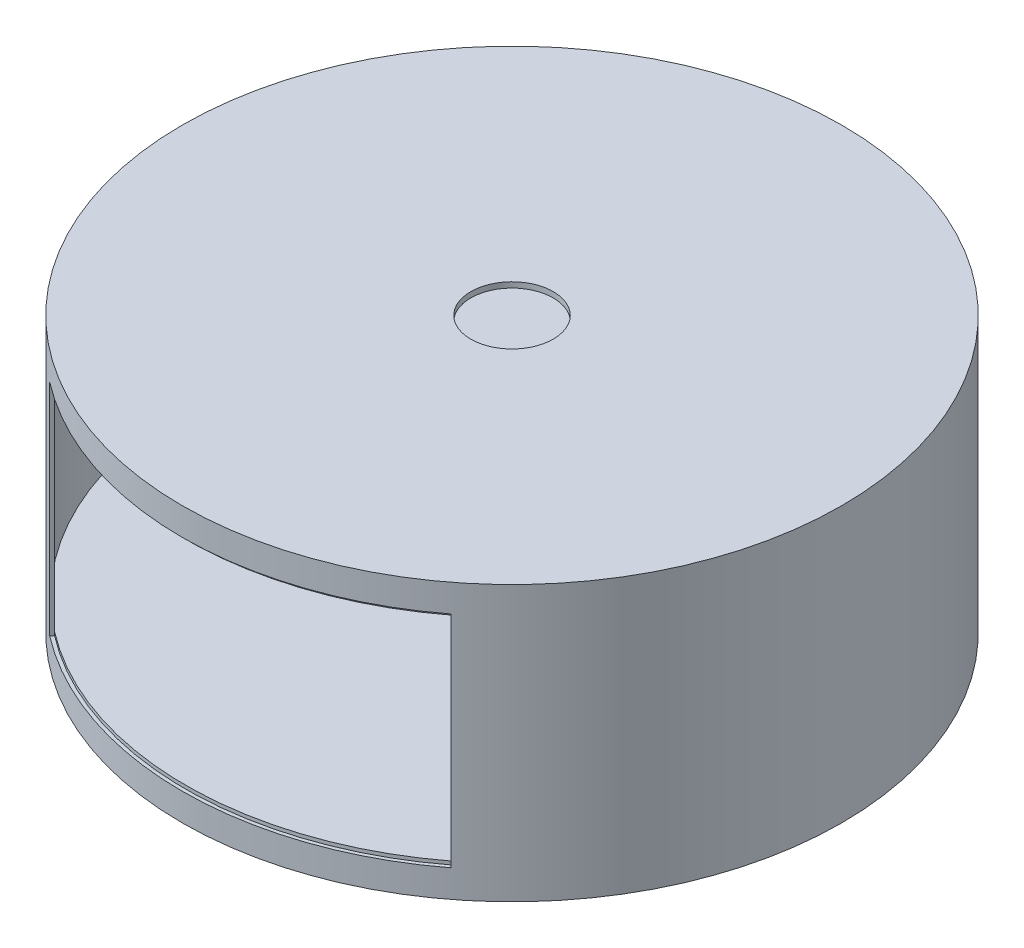
ISO-10303-21;
HEADER;
FILE_DESCRIPTION(('STEP AP214'),'2;1');
FILE_NAME('part.step','',(''),(''),'','','');
FILE_SCHEMA(('AUTOMOTIVE_DESIGN { 1 0 10303 214 1 1 1 1 }'));
ENDSEC;
DATA;
#1=APPLICATION_CONTEXT('core data for automotive mechanical design processes');
#2=APPLICATION_PROTOCOL_DEFINITION('international standard','automotive_design',2000,#1);
#3=PRODUCT_CONTEXT('',#1,'mechanical');
#4=PRODUCT('Part','Part','',(#3));
#5=PRODUCT_RELATED_PRODUCT_CATEGORY('part','',(#4));
#6=PRODUCT_DEFINITION_FORMATION('','',#4);
#7=PRODUCT_DEFINITION_CONTEXT('part definition',#1,'design');
#8=PRODUCT_DEFINITION('design','',#6,#7);
#9=PRODUCT_DEFINITION_SHAPE('','',#8);
#10=(LENGTH_UNIT() NAMED_UNIT(*) SI_UNIT(.MILLI.,.METRE.));
#11=(NAMED_UNIT(*) PLANE_ANGLE_UNIT() SI_UNIT($,.RADIAN.));
#12=(NAMED_UNIT(*) SI_UNIT($,.STERADIAN.) SOLID_ANGLE_UNIT());
#13=UNCERTAINTY_MEASURE_WITH_UNIT(LENGTH_MEASURE(1.E-05),#10,'distance_accuracy_value','');
#14=(GEOMETRIC_REPRESENTATION_CONTEXT(3) GLOBAL_UNCERTAINTY_ASSIGNED_CONTEXT((#13)) GLOBAL_UNIT_ASSIGNED_CONTEXT((#10,
#11,#12)) REPRESENTATION_CONTEXT('',''));
#15=CARTESIAN_POINT('',(0.,0.,0.));
#16=DIRECTION('',(0.,0.,1.));
#17=DIRECTION('',(1.,0.,0.));
#18=AXIS2_PLACEMENT_3D('',#15,#16,#17);
#19=CARTESIAN_POINT('',(0.,-49.2125,0.));
#20=DIRECTION('',(0.,1.,0.));
#21=DIRECTION('',(0.,0.,1.));
#22=AXIS2_PLACEMENT_3D('',#19,#20,#21);
#23=CYLINDRICAL_SURFACE('',#22,150.8125);
#24=CARTESIAN_POINT('',(0.,-49.2125,0.));
#25=DIRECTION('',(0.,1.,0.));
#26=DIRECTION('',(0.,0.,1.));
#27=AXIS2_PLACEMENT_3D('',#24,#25,#26);
#28=CIRCLE('',#27,150.8125);
#29=CARTESIAN_POINT('',(91.8088330123779,-49.2125,119.647600632672));
#30=VERTEX_POINT('',#29);
#31=CARTESIAN_POINT('',(-91.8088330123778,-49.2125,119.647600632672));
#32=VERTEX_POINT('',#31);
#33=EDGE_CURVE('E119',#30,#32,#28,.T.);
#34=ORIENTED_EDGE('',*,*,#33,.F.);
#35=DIRECTION('',(0.,1.,0.));
#36=VECTOR('',#35,1.);
#37=CARTESIAN_POINT('',(91.8088330123779,-50.8,119.647600632672));
#38=LINE('',#37,#36);
#39=CARTESIAN_POINT('',(91.8088330123779,49.2125,119.647600632672));
#40=VERTEX_POINT('',#39);
#41=EDGE_CURVE('E139',#30,#40,#38,.T.);
#42=ORIENTED_EDGE('',*,*,#41,.T.);
#43=CARTESIAN_POINT('',(0.,49.2125,0.));
#44=DIRECTION('',(0.,1.,0.));
#45=DIRECTION('',(0.,0.,1.));
#46=AXIS2_PLACEMENT_3D('',#43,#44,#45);
#47=CIRCLE('',#46,150.8125);
#48=CARTESIAN_POINT('',(-91.8088330123778,49.2125,119.647600632672));
#49=VERTEX_POINT('',#48);
#50=EDGE_CURVE('E122',#40,#49,#47,.T.);
#51=ORIENTED_EDGE('',*,*,#50,.T.);
#52=DIRECTION('',(0.,1.,0.));
#53=VECTOR('',#52,1.);
#54=CARTESIAN_POINT('',(-91.8088330123778,-50.8,119.647600632672));
#55=LINE('',#54,#53);
#56=EDGE_CURVE('E56',#32,#49,#55,.T.);
#57=ORIENTED_EDGE('',*,*,#56,.F.);
#58=EDGE_LOOP('',(#34,#42,#51,#57));
#59=FACE_BOUND('',#58,.T.);
#60=ADVANCED_FACE('F35',(#59),#23,.F.);
#61=CARTESIAN_POINT('',(0.,-49.2125,0.));
#62=DIRECTION('',(0.,1.,0.));
#63=DIRECTION('',(0.,0.,1.));
#64=AXIS2_PLACEMENT_3D('',#61,#62,#63);
#65=PLANE('',#64);
#66=ORIENTED_EDGE('',*,*,#33,.T.);
#67=CARTESIAN_POINT('',(0.,-49.2125,0.));
#68=DIRECTION('',(0.,1.,0.));
#69=DIRECTION('',(0.,0.,1.));
#70=AXIS2_PLACEMENT_3D('',#67,#68,#69);
#71=CIRCLE('',#70,150.8125);
#72=EDGE_CURVE('E110',#32,#30,#71,.T.);
#73=ORIENTED_EDGE('',*,*,#72,.T.);
#74=EDGE_LOOP('',(#66,#73));
#75=FACE_BOUND('',#74,.T.);
#76=ADVANCED_FACE('F148',(#75),#65,.T.);
#77=CARTESIAN_POINT('',(0.,49.2125,0.));
#78=DIRECTION('',(0.,1.,0.));
#79=DIRECTION('',(0.,0.,1.));
#80=AXIS2_PLACEMENT_3D('',#77,#78,#79);
#81=PLANE('',#80);
#82=ORIENTED_EDGE('',*,*,#50,.F.);
#83=EDGE_CURVE('E118',#49,#40,#47,.T.);
#84=ORIENTED_EDGE('',*,*,#83,.F.);
#85=EDGE_LOOP('',(#82,#84));
#86=FACE_BOUND('',#85,.T.);
#87=ADVANCED_FACE('F146',(#86),#81,.F.);
#88=CARTESIAN_POINT('',(0.,0.,0.));
#89=DIRECTION('',(0.,-1.,0.));
#90=DIRECTION('',(0.,0.,-1.));
#91=AXIS2_PLACEMENT_3D('',#88,#89,#90);
#92=CYLINDRICAL_SURFACE('',#91,150.8125);
#93=ORIENTED_EDGE('',*,*,#83,.T.);
#94=CARTESIAN_POINT('',(91.8088330123779,50.8,119.647600632672));
#95=VERTEX_POINT('',#94);
#96=EDGE_CURVE('E132',#40,#95,#38,.T.);
#97=ORIENTED_EDGE('',*,*,#96,.T.);
#98=CARTESIAN_POINT('',(0.,50.8,0.));
#99=DIRECTION('',(0.,-1.,0.));
#100=DIRECTION('',(0.,0.,-1.));
#101=AXIS2_PLACEMENT_3D('',#98,#99,#100);
#102=CIRCLE('',#101,150.8125);
#103=CARTESIAN_POINT('',(-91.8088330123779,50.8,119.647600632672));
#104=VERTEX_POINT('',#103);
#105=EDGE_CURVE('E112',#95,#104,#102,.T.);
#106=ORIENTED_EDGE('',*,*,#105,.T.);
#107=EDGE_CURVE('E102',#49,#104,#55,.T.);
#108=ORIENTED_EDGE('',*,*,#107,.F.);
#109=EDGE_LOOP('',(#93,#97,#106,#108));
#110=FACE_BOUND('',#109,.T.);
#111=ADVANCED_FACE('F130',(#110),#92,.T.);
#112=CARTESIAN_POINT('',(91.8088330123779,50.8,119.647600632672));
#113=DIRECTION('',(0.,-1.,0.));
#114=DIRECTION('',(0.,0.,-1.));
#115=AXIS2_PLACEMENT_3D('',#112,#113,#114);
#116=PLANE('',#115);
#117=CARTESIAN_POINT('',(0.,50.8,0.));
#118=DIRECTION('',(0.,-1.,0.));
#119=DIRECTION('',(0.,0.,-1.));
#120=AXIS2_PLACEMENT_3D('',#117,#118,#119);
#121=CIRCLE('',#120,152.4);
#122=CARTESIAN_POINT('',(92.7752417809292,50.8,120.907049060384));
#123=VERTEX_POINT('',#122);
#124=CARTESIAN_POINT('',(-92.7752417809292,50.8,120.907049060384));
#125=VERTEX_POINT('',#124);
#126=EDGE_CURVE('E108',#123,#125,#121,.T.);
#127=ORIENTED_EDGE('',*,*,#126,.T.);
#128=DIRECTION('',(-0.608761429008722,0.,0.793353340291234));
#129=VECTOR('',#128,1.);
#130=CARTESIAN_POINT('',(-91.8088330123779,50.8,119.647600632672));
#131=LINE('',#130,#129);
#132=EDGE_CURVE('E50',#104,#125,#131,.T.);
#133=ORIENTED_EDGE('',*,*,#132,.F.);
#134=ORIENTED_EDGE('',*,*,#105,.F.);
#135=DIRECTION('',(0.608761429008722,0.,0.793353340291234));
#136=VECTOR('',#135,1.);
#137=CARTESIAN_POINT('',(91.8088330123779,50.8,119.647600632672));
#138=LINE('',#137,#136);
#139=EDGE_CURVE('E141',#95,#123,#138,.T.);
#140=ORIENTED_EDGE('',*,*,#139,.T.);
#141=EDGE_LOOP('',(#127,#133,#134,#140));
#142=FACE_BOUND('',#141,.T.);
#143=ADVANCED_FACE('F154',(#142),#116,.T.);
#144=CARTESIAN_POINT('',(92.7752417809292,-50.8,120.907049060384));
#145=DIRECTION('',(0.,1.,0.));
#146=DIRECTION('',(0.,0.,1.));
#147=AXIS2_PLACEMENT_3D('',#144,#145,#146);
#148=PLANE('',#147);
#149=CARTESIAN_POINT('',(0.,-50.8,0.));
#150=DIRECTION('',(0.,-1.,0.));
#151=DIRECTION('',(0.,0.,-1.));
#152=AXIS2_PLACEMENT_3D('',#149,#150,#151);
#153=CIRCLE('',#152,150.8125);
#154=CARTESIAN_POINT('',(91.8088330123779,-50.8,119.647600632672));
#155=VERTEX_POINT('',#154);
#156=CARTESIAN_POINT('',(-91.8088330123778,-50.8,119.647600632672));
#157=VERTEX_POINT('',#156);
#158=EDGE_CURVE('E101',#155,#157,#153,.T.);
#159=ORIENTED_EDGE('',*,*,#158,.T.);
#160=DIRECTION('',(0.608761429008722,0.,-0.793353340291234));
#161=VECTOR('',#160,1.);
#162=CARTESIAN_POINT('',(-92.7752417809292,-50.8,120.907049060384));
#163=LINE('',#162,#161);
#164=CARTESIAN_POINT('',(-92.7752417809292,-50.8,120.907049060384));
#165=VERTEX_POINT('',#164);
#166=EDGE_CURVE('E90',#165,#157,#163,.T.);
#167=ORIENTED_EDGE('',*,*,#166,.F.);
#168=CARTESIAN_POINT('',(0.,-50.8,0.));
#169=DIRECTION('',(0.,-1.,0.));
#170=DIRECTION('',(0.,0.,-1.));
#171=AXIS2_PLACEMENT_3D('',#168,#169,#170);
#172=CIRCLE('',#171,152.4);
#173=CARTESIAN_POINT('',(92.7752417809292,-50.8,120.907049060384));
#174=VERTEX_POINT('',#173);
#175=EDGE_CURVE('E99',#174,#165,#172,.T.);
#176=ORIENTED_EDGE('',*,*,#175,.F.);
#177=DIRECTION('',(-0.608761429008722,0.,-0.793353340291234));
#178=VECTOR('',#177,1.);
#179=CARTESIAN_POINT('',(92.7752417809292,-50.8,120.907049060384));
#180=LINE('',#179,#178);
#181=EDGE_CURVE('E142',#174,#155,#180,.T.);
#182=ORIENTED_EDGE('',*,*,#181,.T.);
#183=EDGE_LOOP('',(#159,#167,#176,#182));
#184=FACE_BOUND('',#183,.T.);
#185=ADVANCED_FACE('F97',(#184),#148,.T.);
#186=EDGE_CURVE('E251',#157,#32,#55,.T.);
#187=ORIENTED_EDGE('',*,*,#186,.F.);
#188=ORIENTED_EDGE('',*,*,#158,.F.);
#189=EDGE_CURVE('E144',#155,#30,#38,.T.);
#190=ORIENTED_EDGE('',*,*,#189,.T.);
#191=ORIENTED_EDGE('',*,*,#72,.F.);
#192=EDGE_LOOP('',(#187,#188,#190,#191));
#193=FACE_BOUND('',#192,.T.);
#194=ADVANCED_FACE('F156',(#193),#92,.T.);
#195=CARTESIAN_POINT('',(0.,0.,0.));
#196=DIRECTION('',(0.793353340291234,0.,-0.608761429008722));
#197=DIRECTION('',(-0.608761429008722,0.,-0.793353340291234));
#198=AXIS2_PLACEMENT_3D('',#195,#196,#197);
#199=PLANE('',#198);
#200=ORIENTED_EDGE('',*,*,#139,.F.);
#201=ORIENTED_EDGE('',*,*,#96,.F.);
#202=ORIENTED_EDGE('',*,*,#41,.F.);
#203=ORIENTED_EDGE('',*,*,#189,.F.);
#204=ORIENTED_EDGE('',*,*,#181,.F.);
#205=DIRECTION('',(0.,-1.,0.));
#206=VECTOR('',#205,1.);
#207=CARTESIAN_POINT('',(92.7752417809292,50.8,120.907049060384));
#208=LINE('',#207,#206);
#209=EDGE_CURVE('E107',#123,#174,#208,.T.);
#210=ORIENTED_EDGE('',*,*,#209,.F.);
#211=EDGE_LOOP('',(#200,#201,#202,#203,#204,#210));
#212=FACE_BOUND('',#211,.T.);
#213=ADVANCED_FACE('F137',(#212),#199,.F.);
#214=CARTESIAN_POINT('',(0.,0.,0.));
#215=DIRECTION('',(0.793353340291234,0.,0.608761429008722));
#216=DIRECTION('',(0.608761429008722,0.,-0.793353340291234));
#217=AXIS2_PLACEMENT_3D('',#214,#215,#216);
#218=PLANE('',#217);
#219=ORIENTED_EDGE('',*,*,#132,.T.);
#220=DIRECTION('',(0.,-1.,0.));
#221=VECTOR('',#220,1.);
#222=CARTESIAN_POINT('',(-92.7752417809292,50.8,120.907049060384));
#223=LINE('',#222,#221);
#224=EDGE_CURVE('E87',#125,#165,#223,.T.);
#225=ORIENTED_EDGE('',*,*,#224,.T.);
#226=ORIENTED_EDGE('',*,*,#166,.T.);
#227=ORIENTED_EDGE('',*,*,#186,.T.);
#228=ORIENTED_EDGE('',*,*,#56,.T.);
#229=ORIENTED_EDGE('',*,*,#107,.T.);
#230=EDGE_LOOP('',(#219,#225,#226,#227,#228,#229));
#231=FACE_BOUND('',#230,.T.);
#232=ADVANCED_FACE('F89',(#231),#218,.T.);
#233=CARTESIAN_POINT('',(0.,63.5,0.));
#234=DIRECTION('',(0.,-1.,0.));
#235=DIRECTION('',(0.,0.,-1.));
#236=AXIS2_PLACEMENT_3D('',#233,#234,#235);
#237=CYLINDRICAL_SURFACE('',#236,152.4);
#238=ORIENTED_EDGE('',*,*,#126,.F.);
#239=ORIENTED_EDGE('',*,*,#209,.T.);
#240=ORIENTED_EDGE('',*,*,#175,.T.);
#241=ORIENTED_EDGE('',*,*,#224,.F.);
#242=EDGE_LOOP('',(#238,#239,#240,#241));
#243=FACE_BOUND('',#242,.T.);
#244=CARTESIAN_POINT('',(0.,63.5,0.));
#245=DIRECTION('',(0.,1.,0.));
#246=DIRECTION('',(0.,0.,1.));
#247=AXIS2_PLACEMENT_3D('',#244,#245,#246);
#248=CIRCLE('',#247,152.4);
#249=CARTESIAN_POINT('',(0.,63.5,152.4));
#250=VERTEX_POINT('',#249);
#251=EDGE_CURVE('E11',#250,#250,#248,.T.);
#252=ORIENTED_EDGE('',*,*,#251,.F.);
#253=EDGE_LOOP('',(#252));
#254=FACE_BOUND('',#253,.T.);
#255=CARTESIAN_POINT('',(0.,-63.5,0.));
#256=DIRECTION('',(0.,1.,0.));
#257=DIRECTION('',(0.,0.,1.));
#258=AXIS2_PLACEMENT_3D('',#255,#256,#257);
#259=CIRCLE('',#258,152.4);
#260=CARTESIAN_POINT('',(0.,-63.5,152.4));
#261=VERTEX_POINT('',#260);
#262=EDGE_CURVE('E39',#261,#261,#259,.T.);
#263=ORIENTED_EDGE('',*,*,#262,.T.);
#264=EDGE_LOOP('',(#263));
#265=FACE_BOUND('',#264,.T.);
#266=ADVANCED_FACE('F37',(#243,#254,#265),#237,.T.);
#267=CARTESIAN_POINT('',(0.,63.5,0.));
#268=DIRECTION('',(0.,1.,0.));
#269=DIRECTION('',(0.,0.,1.));
#270=AXIS2_PLACEMENT_3D('',#267,#268,#269);
#271=PLANE('',#270);
#272=CARTESIAN_POINT('',(0.,63.5,0.));
#273=DIRECTION('',(0.,1.,0.));
#274=DIRECTION('',(0.,0.,1.));
#275=AXIS2_PLACEMENT_3D('',#272,#273,#274);
#276=CIRCLE('',#275,19.05);
#277=CARTESIAN_POINT('',(0.,63.5,19.05));
#278=VERTEX_POINT('',#277);
#279=EDGE_CURVE('E245',#278,#278,#276,.T.);
#280=ORIENTED_EDGE('',*,*,#279,.F.);
#281=EDGE_LOOP('',(#280));
#282=FACE_BOUND('',#281,.T.);
#283=ORIENTED_EDGE('',*,*,#251,.T.);
#284=EDGE_LOOP('',(#283));
#285=FACE_BOUND('',#284,.T.);
#286=ADVANCED_FACE('F164',(#282,#285),#271,.T.);
#287=CARTESIAN_POINT('',(0.,-63.5,0.));
#288=DIRECTION('',(0.,1.,0.));
#289=DIRECTION('',(0.,0.,1.));
#290=AXIS2_PLACEMENT_3D('',#287,#288,#289);
#291=PLANE('',#290);
#292=ORIENTED_EDGE('',*,*,#262,.F.);
#293=EDGE_LOOP('',(#292));
#294=FACE_BOUND('',#293,.T.);
#295=ADVANCED_FACE('F166',(#294),#291,.F.);
#296=CARTESIAN_POINT('',(0.,60.96,0.));
#297=DIRECTION('',(0.,1.,0.));
#298=DIRECTION('',(0.,0.,1.));
#299=AXIS2_PLACEMENT_3D('',#296,#297,#298);
#300=CYLINDRICAL_SURFACE('',#299,19.05);
#301=CARTESIAN_POINT('',(0.,60.96,0.));
#302=DIRECTION('',(0.,1.,0.));
#303=DIRECTION('',(0.,0.,1.));
#304=AXIS2_PLACEMENT_3D('',#301,#302,#303);
#305=CIRCLE('',#304,19.05);
#306=CARTESIAN_POINT('',(0.,60.96,19.05));
#307=VERTEX_POINT('',#306);
#308=EDGE_CURVE('E244',#307,#307,#305,.T.);
#309=ORIENTED_EDGE('',*,*,#308,.F.);
#310=EDGE_LOOP('',(#309));
#311=FACE_BOUND('',#310,.T.);
#312=ORIENTED_EDGE('',*,*,#279,.T.);
#313=EDGE_LOOP('',(#312));
#314=FACE_BOUND('',#313,.T.);
#315=ADVANCED_FACE('F169',(#311,#314),#300,.F.);
#316=CARTESIAN_POINT('',(0.,60.96,0.));
#317=DIRECTION('',(0.,1.,0.));
#318=DIRECTION('',(0.,0.,1.));
#319=AXIS2_PLACEMENT_3D('',#316,#317,#318);
#320=PLANE('',#319);
#321=ORIENTED_EDGE('',*,*,#308,.T.);
#322=EDGE_LOOP('',(#321));
#323=FACE_BOUND('',#322,.T.);
#324=ADVANCED_FACE('F174',(#323),#320,.T.);
#325=CLOSED_SHELL('',(#60,#76,#87,#111,#143,#185,#194,#213,#232,#266,#286,#295,#315,#324));
#326=MANIFOLD_SOLID_BREP('B2',#325);
#327=ADVANCED_BREP_SHAPE_REPRESENTATION('',(#18,#326),#14);
#328=SHAPE_DEFINITION_REPRESENTATION(#9,#327);
ENDSEC;
END-ISO-10303-21;
